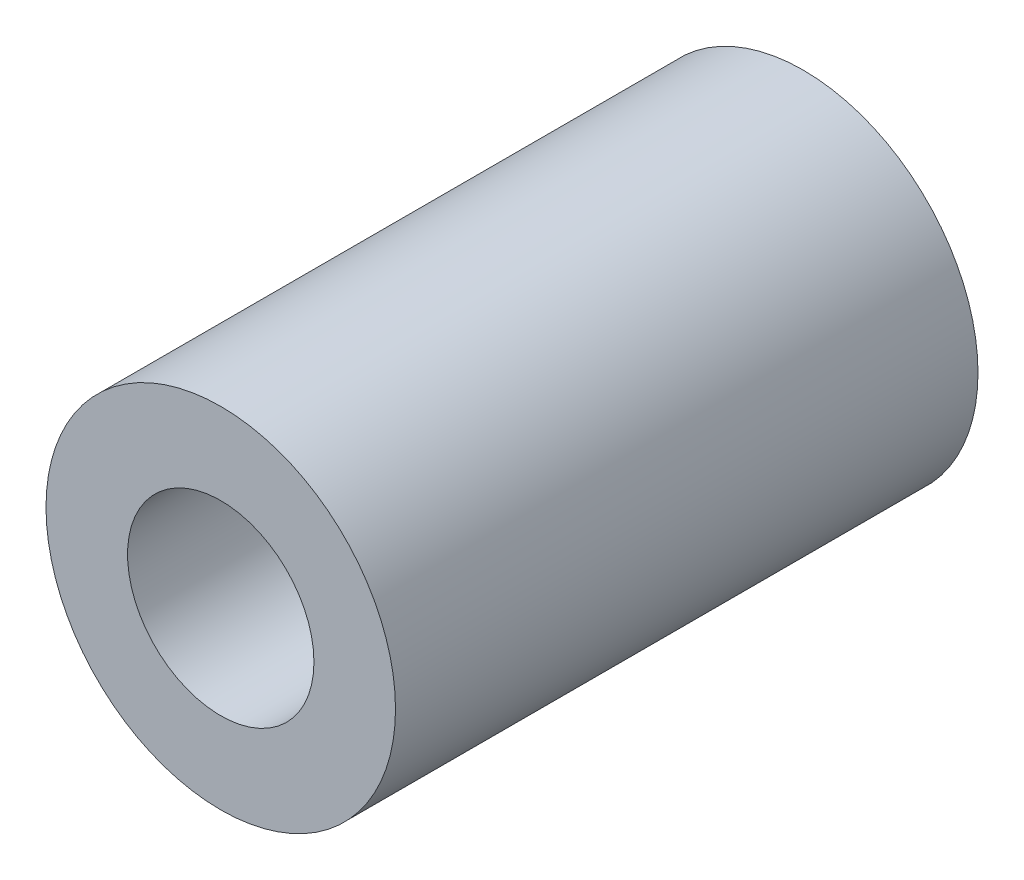
ISO-10303-21;
HEADER;
FILE_DESCRIPTION(('STEP AP214'),'2;1');
FILE_NAME('part.step','',(''),(''),'','','');
FILE_SCHEMA(('AUTOMOTIVE_DESIGN { 1 0 10303 214 1 1 1 1 }'));
ENDSEC;
DATA;
#1=APPLICATION_CONTEXT('core data for automotive mechanical design processes');
#2=APPLICATION_PROTOCOL_DEFINITION('international standard','automotive_design',2000,#1);
#3=PRODUCT_CONTEXT('',#1,'mechanical');
#4=PRODUCT('Part','Part','',(#3));
#5=PRODUCT_RELATED_PRODUCT_CATEGORY('part','',(#4));
#6=PRODUCT_DEFINITION_FORMATION('','',#4);
#7=PRODUCT_DEFINITION_CONTEXT('part definition',#1,'design');
#8=PRODUCT_DEFINITION('design','',#6,#7);
#9=PRODUCT_DEFINITION_SHAPE('','',#8);
#10=(LENGTH_UNIT() NAMED_UNIT(*) SI_UNIT(.MILLI.,.METRE.));
#11=(NAMED_UNIT(*) PLANE_ANGLE_UNIT() SI_UNIT($,.RADIAN.));
#12=(NAMED_UNIT(*) SI_UNIT($,.STERADIAN.) SOLID_ANGLE_UNIT());
#13=UNCERTAINTY_MEASURE_WITH_UNIT(LENGTH_MEASURE(1.E-05),#10,'distance_accuracy_value','');
#14=(GEOMETRIC_REPRESENTATION_CONTEXT(3) GLOBAL_UNCERTAINTY_ASSIGNED_CONTEXT((#13)) GLOBAL_UNIT_ASSIGNED_CONTEXT((#10,
#11,#12)) REPRESENTATION_CONTEXT('',''));
#15=CARTESIAN_POINT('',(0.,0.,0.));
#16=DIRECTION('',(0.,0.,1.));
#17=DIRECTION('',(1.,0.,0.));
#18=AXIS2_PLACEMENT_3D('',#15,#16,#17);
#19=CARTESIAN_POINT('',(0.,0.,5.));
#20=DIRECTION('',(0.,0.,1.));
#21=DIRECTION('',(1.,0.,0.));
#22=AXIS2_PLACEMENT_3D('',#19,#20,#21);
#23=PLANE('',#22);
#24=CARTESIAN_POINT('',(0.,0.,5.));
#25=DIRECTION('',(0.,0.,1.));
#26=DIRECTION('',(1.,0.,0.));
#27=AXIS2_PLACEMENT_3D('',#24,#25,#26);
#28=CIRCLE('',#27,3.);
#29=CARTESIAN_POINT('',(3.,0.,5.));
#30=VERTEX_POINT('',#29);
#31=EDGE_CURVE('E10',#30,#30,#28,.T.);
#32=ORIENTED_EDGE('',*,*,#31,.T.);
#33=EDGE_LOOP('',(#32));
#34=FACE_BOUND('',#33,.T.);
#35=CARTESIAN_POINT('',(0.,0.,5.));
#36=DIRECTION('',(0.,0.,1.));
#37=DIRECTION('',(1.,0.,0.));
#38=AXIS2_PLACEMENT_3D('',#35,#36,#37);
#39=CIRCLE('',#38,1.6);
#40=CARTESIAN_POINT('',(1.6,0.,5.));
#41=VERTEX_POINT('',#40);
#42=EDGE_CURVE('E41',#41,#41,#39,.T.);
#43=ORIENTED_EDGE('',*,*,#42,.F.);
#44=EDGE_LOOP('',(#43));
#45=FACE_BOUND('',#44,.T.);
#46=ADVANCED_FACE('F30',(#34,#45),#23,.T.);
#47=CARTESIAN_POINT('',(0.,0.,-5.));
#48=DIRECTION('',(0.,0.,1.));
#49=DIRECTION('',(1.,0.,0.));
#50=AXIS2_PLACEMENT_3D('',#47,#48,#49);
#51=PLANE('',#50);
#52=CARTESIAN_POINT('',(0.,0.,-5.));
#53=DIRECTION('',(0.,0.,1.));
#54=DIRECTION('',(1.,0.,0.));
#55=AXIS2_PLACEMENT_3D('',#52,#53,#54);
#56=CIRCLE('',#55,3.);
#57=CARTESIAN_POINT('',(3.,0.,-5.));
#58=VERTEX_POINT('',#57);
#59=EDGE_CURVE('E34',#58,#58,#56,.T.);
#60=ORIENTED_EDGE('',*,*,#59,.F.);
#61=EDGE_LOOP('',(#60));
#62=FACE_BOUND('',#61,.T.);
#63=CARTESIAN_POINT('',(0.,0.,-5.));
#64=DIRECTION('',(0.,0.,1.));
#65=DIRECTION('',(1.,0.,0.));
#66=AXIS2_PLACEMENT_3D('',#63,#64,#65);
#67=CIRCLE('',#66,1.6);
#68=CARTESIAN_POINT('',(1.6,0.,-5.));
#69=VERTEX_POINT('',#68);
#70=EDGE_CURVE('E43',#69,#69,#67,.T.);
#71=ORIENTED_EDGE('',*,*,#70,.T.);
#72=EDGE_LOOP('',(#71));
#73=FACE_BOUND('',#72,.T.);
#74=ADVANCED_FACE('F53',(#62,#73),#51,.F.);
#75=CARTESIAN_POINT('',(0.,0.,5.));
#76=DIRECTION('',(0.,0.,-1.));
#77=DIRECTION('',(-1.,0.,0.));
#78=AXIS2_PLACEMENT_3D('',#75,#76,#77);
#79=CYLINDRICAL_SURFACE('',#78,3.);
#80=ORIENTED_EDGE('',*,*,#31,.F.);
#81=EDGE_LOOP('',(#80));
#82=FACE_BOUND('',#81,.T.);
#83=ORIENTED_EDGE('',*,*,#59,.T.);
#84=EDGE_LOOP('',(#83));
#85=FACE_BOUND('',#84,.T.);
#86=ADVANCED_FACE('F32',(#82,#85),#79,.T.);
#87=CARTESIAN_POINT('',(0.,0.,5.));
#88=DIRECTION('',(0.,0.,-1.));
#89=DIRECTION('',(-1.,0.,0.));
#90=AXIS2_PLACEMENT_3D('',#87,#88,#89);
#91=CYLINDRICAL_SURFACE('',#90,1.6);
#92=ORIENTED_EDGE('',*,*,#42,.T.);
#93=EDGE_LOOP('',(#92));
#94=FACE_BOUND('',#93,.T.);
#95=ORIENTED_EDGE('',*,*,#70,.F.);
#96=EDGE_LOOP('',(#95));
#97=FACE_BOUND('',#96,.T.);
#98=ADVANCED_FACE('F49',(#94,#97),#91,.F.);
#99=CLOSED_SHELL('',(#46,#74,#86,#98));
#100=MANIFOLD_SOLID_BREP('B2',#99);
#101=ADVANCED_BREP_SHAPE_REPRESENTATION('',(#18,#100),#14);
#102=SHAPE_DEFINITION_REPRESENTATION(#9,#101);
ENDSEC;
END-ISO-10303-21;
